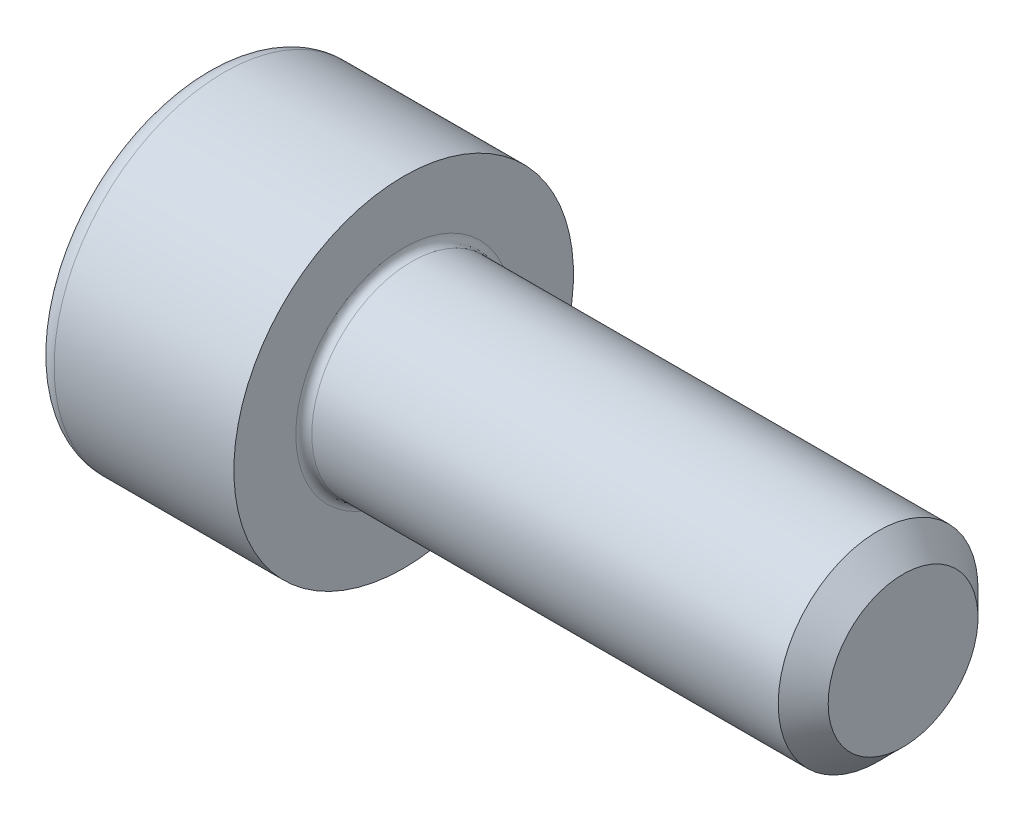
ISO-10303-21;
HEADER;
FILE_DESCRIPTION(('STEP AP214'),'2;1');
FILE_NAME('part.step','',(''),(''),'','','');
FILE_SCHEMA(('AUTOMOTIVE_DESIGN { 1 0 10303 214 1 1 1 1 }'));
ENDSEC;
DATA;
#1=APPLICATION_CONTEXT('core data for automotive mechanical design processes');
#2=APPLICATION_PROTOCOL_DEFINITION('international standard','automotive_design',2000,#1);
#3=PRODUCT_CONTEXT('',#1,'mechanical');
#4=PRODUCT('Part','Part','',(#3));
#5=PRODUCT_RELATED_PRODUCT_CATEGORY('part','',(#4));
#6=PRODUCT_DEFINITION_FORMATION('','',#4);
#7=PRODUCT_DEFINITION_CONTEXT('part definition',#1,'design');
#8=PRODUCT_DEFINITION('design','',#6,#7);
#9=PRODUCT_DEFINITION_SHAPE('','',#8);
#10=(LENGTH_UNIT() NAMED_UNIT(*) SI_UNIT(.MILLI.,.METRE.));
#11=(NAMED_UNIT(*) PLANE_ANGLE_UNIT() SI_UNIT($,.RADIAN.));
#12=(NAMED_UNIT(*) SI_UNIT($,.STERADIAN.) SOLID_ANGLE_UNIT());
#13=UNCERTAINTY_MEASURE_WITH_UNIT(LENGTH_MEASURE(1.E-05),#10,'distance_accuracy_value','');
#14=(GEOMETRIC_REPRESENTATION_CONTEXT(3) GLOBAL_UNCERTAINTY_ASSIGNED_CONTEXT((#13)) GLOBAL_UNIT_ASSIGNED_CONTEXT((#10,
#11,#12)) REPRESENTATION_CONTEXT('',''));
#15=CARTESIAN_POINT('',(0.,0.,0.));
#16=DIRECTION('',(0.,0.,1.));
#17=DIRECTION('',(1.,0.,0.));
#18=AXIS2_PLACEMENT_3D('',#15,#16,#17);
#19=CARTESIAN_POINT('',(-1.99999999995271,0.,0.));
#20=DIRECTION('',(-1.,0.,0.));
#21=DIRECTION('',(0.,0.,1.));
#22=AXIS2_PLACEMENT_3D('',#19,#20,#21);
#23=CONICAL_SURFACE('',#22,1.83319999985088,1.04719755109013);
#24=CARTESIAN_POINT('',(-0.941601486488253,-1.13686837721616E-10,0.));
#25=VERTEX_POINT('',#24);
#26=VERTEX_LOOP('',#25);
#27=FACE_BOUND('',#26,.T.);
#28=CARTESIAN_POINT('',(-2.00000000001834,0.,0.));
#29=DIRECTION('',(-1.,0.,0.));
#30=DIRECTION('',(0.,0.,1.));
#31=AXIS2_PLACEMENT_3D('',#28,#29,#30);
#32=CIRCLE('',#31,1.83319999996456);
#33=CARTESIAN_POINT('',(-2.00000000001834,-0.916599999982282,-1.58759777018694));
#34=VERTEX_POINT('',#33);
#35=CARTESIAN_POINT('',(-2.00000000001834,-1.83319999996456,0.));
#36=VERTEX_POINT('',#35);
#37=EDGE_CURVE('E89',#34,#36,#32,.T.);
#38=ORIENTED_EDGE('',*,*,#37,.T.);
#39=CARTESIAN_POINT('',(-2.00000000001834,0.,0.));
#40=DIRECTION('',(-1.,0.,0.));
#41=DIRECTION('',(0.,0.,1.));
#42=AXIS2_PLACEMENT_3D('',#39,#40,#41);
#43=CIRCLE('',#42,1.83319999996456);
#44=CARTESIAN_POINT('',(-2.00000000001834,-0.916599999982281,1.58759777018694));
#45=VERTEX_POINT('',#44);
#46=EDGE_CURVE('E84',#36,#45,#43,.T.);
#47=ORIENTED_EDGE('',*,*,#46,.T.);
#48=CARTESIAN_POINT('',(-2.00000000001834,0.,0.));
#49=DIRECTION('',(-1.,0.,0.));
#50=DIRECTION('',(0.,0.,1.));
#51=AXIS2_PLACEMENT_3D('',#48,#49,#50);
#52=CIRCLE('',#51,1.83319999996456);
#53=CARTESIAN_POINT('',(-1.99999999995271,0.916599999925436,1.58759777008849));
#54=VERTEX_POINT('',#53);
#55=EDGE_CURVE('E86',#45,#54,#52,.T.);
#56=ORIENTED_EDGE('',*,*,#55,.T.);
#57=CARTESIAN_POINT('',(-1.99999999995271,0.,0.));
#58=DIRECTION('',(-1.,0.,0.));
#59=DIRECTION('',(0.,0.,1.));
#60=AXIS2_PLACEMENT_3D('',#57,#58,#59);
#61=CIRCLE('',#60,1.83319999985088);
#62=CARTESIAN_POINT('',(-1.99999999995271,1.83319999985088,0.));
#63=VERTEX_POINT('',#62);
#64=EDGE_CURVE('E100',#54,#63,#61,.T.);
#65=ORIENTED_EDGE('',*,*,#64,.T.);
#66=CARTESIAN_POINT('',(-2.00000000001834,0.,0.));
#67=DIRECTION('',(-1.,0.,0.));
#68=DIRECTION('',(0.,0.,1.));
#69=AXIS2_PLACEMENT_3D('',#66,#67,#68);
#70=CIRCLE('',#69,1.83319999996456);
#71=CARTESIAN_POINT('',(-2.00000000001834,0.91659999998228,-1.58759777018694));
#72=VERTEX_POINT('',#71);
#73=EDGE_CURVE('E187',#63,#72,#70,.T.);
#74=ORIENTED_EDGE('',*,*,#73,.T.);
#75=CARTESIAN_POINT('',(-2.00000000001834,0.,0.));
#76=DIRECTION('',(-1.,0.,0.));
#77=DIRECTION('',(0.,0.,1.));
#78=AXIS2_PLACEMENT_3D('',#75,#76,#77);
#79=CIRCLE('',#78,1.83319999996456);
#80=EDGE_CURVE('E185',#72,#34,#79,.T.);
#81=ORIENTED_EDGE('',*,*,#80,.T.);
#82=EDGE_LOOP('',(#38,#47,#56,#65,#74,#81));
#83=FACE_BOUND('',#82,.T.);
#84=ADVANCED_FACE('F17',(#27,#83),#23,.F.);
#85=CARTESIAN_POINT('',(-2.,0.,0.));
#86=DIRECTION('',(-1.,0.,0.));
#87=DIRECTION('',(0.,-1.,0.));
#88=AXIS2_PLACEMENT_3D('',#85,#86,#87);
#89=PLANE('',#88);
#90=ORIENTED_EDGE('',*,*,#55,.F.);
#91=DIRECTION('',(0.,-1.,0.));
#92=VECTOR('',#91,1.);
#93=CARTESIAN_POINT('',(-2.,-0.9166,1.58759777021763));
#94=LINE('',#93,#92);
#95=EDGE_CURVE('E94',#45,#54,#94,.F.);
#96=ORIENTED_EDGE('',*,*,#95,.T.);
#97=EDGE_LOOP('',(#90,#96));
#98=FACE_BOUND('',#97,.T.);
#99=ADVANCED_FACE('F97',(#98),#89,.F.);
#100=CARTESIAN_POINT('',(-2.,0.,0.));
#101=DIRECTION('',(-1.,0.,0.));
#102=DIRECTION('',(0.,-1.,0.));
#103=AXIS2_PLACEMENT_3D('',#100,#101,#102);
#104=PLANE('',#103);
#105=ORIENTED_EDGE('',*,*,#64,.F.);
#106=DIRECTION('',(0.,-0.5,0.866025403784439));
#107=VECTOR('',#106,1.);
#108=CARTESIAN_POINT('',(-2.,0.9166,1.58759777021763));
#109=LINE('',#108,#107);
#110=EDGE_CURVE('E163',#54,#63,#109,.F.);
#111=ORIENTED_EDGE('',*,*,#110,.T.);
#112=EDGE_LOOP('',(#105,#111));
#113=FACE_BOUND('',#112,.T.);
#114=ADVANCED_FACE('F294',(#113),#104,.F.);
#115=CARTESIAN_POINT('',(-2.,0.,0.));
#116=DIRECTION('',(-1.,0.,0.));
#117=DIRECTION('',(0.,-1.,0.));
#118=AXIS2_PLACEMENT_3D('',#115,#116,#117);
#119=PLANE('',#118);
#120=ORIENTED_EDGE('',*,*,#73,.F.);
#121=DIRECTION('',(0.,0.5,0.866025403784439));
#122=VECTOR('',#121,1.);
#123=CARTESIAN_POINT('',(-2.,1.8332,0.));
#124=LINE('',#123,#122);
#125=EDGE_CURVE('E152',#63,#72,#124,.F.);
#126=ORIENTED_EDGE('',*,*,#125,.T.);
#127=EDGE_LOOP('',(#120,#126));
#128=FACE_BOUND('',#127,.T.);
#129=ADVANCED_FACE('F298',(#128),#119,.F.);
#130=CARTESIAN_POINT('',(-2.,0.,0.));
#131=DIRECTION('',(-1.,0.,0.));
#132=DIRECTION('',(0.,-1.,0.));
#133=AXIS2_PLACEMENT_3D('',#130,#131,#132);
#134=PLANE('',#133);
#135=ORIENTED_EDGE('',*,*,#80,.F.);
#136=DIRECTION('',(0.,1.,0.));
#137=VECTOR('',#136,1.);
#138=CARTESIAN_POINT('',(-2.,0.9166,-1.58759777021763));
#139=LINE('',#138,#137);
#140=EDGE_CURVE('E140',#72,#34,#139,.F.);
#141=ORIENTED_EDGE('',*,*,#140,.T.);
#142=EDGE_LOOP('',(#135,#141));
#143=FACE_BOUND('',#142,.T.);
#144=ADVANCED_FACE('F305',(#143),#134,.F.);
#145=CARTESIAN_POINT('',(-2.,0.,0.));
#146=DIRECTION('',(-1.,0.,0.));
#147=DIRECTION('',(0.,-1.,0.));
#148=AXIS2_PLACEMENT_3D('',#145,#146,#147);
#149=PLANE('',#148);
#150=ORIENTED_EDGE('',*,*,#37,.F.);
#151=DIRECTION('',(0.,0.5,-0.866025403784438));
#152=VECTOR('',#151,1.);
#153=CARTESIAN_POINT('',(-2.,-0.9166,-1.58759777021763));
#154=LINE('',#153,#152);
#155=EDGE_CURVE('E126',#34,#36,#154,.F.);
#156=ORIENTED_EDGE('',*,*,#155,.T.);
#157=EDGE_LOOP('',(#150,#156));
#158=FACE_BOUND('',#157,.T.);
#159=ADVANCED_FACE('F308',(#158),#149,.F.);
#160=CARTESIAN_POINT('',(-2.,0.,0.));
#161=DIRECTION('',(-1.,0.,0.));
#162=DIRECTION('',(0.,-1.,0.));
#163=AXIS2_PLACEMENT_3D('',#160,#161,#162);
#164=PLANE('',#163);
#165=ORIENTED_EDGE('',*,*,#46,.F.);
#166=DIRECTION('',(0.,-0.5,-0.866025403784438));
#167=VECTOR('',#166,1.);
#168=CARTESIAN_POINT('',(-2.,-1.8332,0.));
#169=LINE('',#168,#167);
#170=EDGE_CURVE('E102',#36,#45,#169,.F.);
#171=ORIENTED_EDGE('',*,*,#170,.T.);
#172=EDGE_LOOP('',(#165,#171));
#173=FACE_BOUND('',#172,.T.);
#174=ADVANCED_FACE('F103',(#173),#164,.F.);
#175=CARTESIAN_POINT('',(-2.,-0.9166,1.58759777021763));
#176=DIRECTION('',(0.,0.,1.));
#177=DIRECTION('',(0.,-1.,0.));
#178=AXIS2_PLACEMENT_3D('',#175,#176,#177);
#179=PLANE('',#178);
#180=DIRECTION('',(1.,0.,0.));
#181=VECTOR('',#180,1.);
#182=CARTESIAN_POINT('',(-2.,0.9166,1.58759777021763));
#183=LINE('',#182,#181);
#184=CARTESIAN_POINT('',(-4.,0.916599999999999,1.58759777021763));
#185=VERTEX_POINT('',#184);
#186=EDGE_CURVE('E114',#185,#54,#183,.T.);
#187=ORIENTED_EDGE('',*,*,#186,.T.);
#188=ORIENTED_EDGE('',*,*,#95,.F.);
#189=DIRECTION('',(1.,0.,0.));
#190=VECTOR('',#189,1.);
#191=CARTESIAN_POINT('',(-2.,-0.9166,1.58759777021763));
#192=LINE('',#191,#190);
#193=CARTESIAN_POINT('',(-4.,-0.9166,1.58759777021763));
#194=VERTEX_POINT('',#193);
#195=EDGE_CURVE('E107',#45,#194,#192,.F.);
#196=ORIENTED_EDGE('',*,*,#195,.T.);
#197=DIRECTION('',(0.,1.,0.));
#198=VECTOR('',#197,1.);
#199=CARTESIAN_POINT('',(-4.,1.8332,1.58759777021763));
#200=LINE('',#199,#198);
#201=EDGE_CURVE('E121',#194,#185,#200,.T.);
#202=ORIENTED_EDGE('',*,*,#201,.T.);
#203=EDGE_LOOP('',(#187,#188,#196,#202));
#204=FACE_BOUND('',#203,.T.);
#205=ADVANCED_FACE('F111',(#204),#179,.F.);
#206=CARTESIAN_POINT('',(-2.,0.9166,1.58759777021763));
#207=DIRECTION('',(0.,0.866025403784439,0.5));
#208=DIRECTION('',(0.,-0.5,0.866025403784439));
#209=AXIS2_PLACEMENT_3D('',#206,#207,#208);
#210=PLANE('',#209);
#211=DIRECTION('',(1.,0.,0.));
#212=VECTOR('',#211,1.);
#213=CARTESIAN_POINT('',(-2.,1.8332,0.));
#214=LINE('',#213,#212);
#215=CARTESIAN_POINT('',(-4.,1.8332,0.));
#216=VERTEX_POINT('',#215);
#217=EDGE_CURVE('E157',#216,#63,#214,.T.);
#218=ORIENTED_EDGE('',*,*,#217,.T.);
#219=ORIENTED_EDGE('',*,*,#110,.F.);
#220=ORIENTED_EDGE('',*,*,#186,.F.);
#221=DIRECTION('',(0.,0.500000000000001,-0.866025403784438));
#222=VECTOR('',#221,1.);
#223=CARTESIAN_POINT('',(-4.,0.9166,1.58759777021763));
#224=LINE('',#223,#222);
#225=EDGE_CURVE('E123',#185,#216,#224,.T.);
#226=ORIENTED_EDGE('',*,*,#225,.T.);
#227=EDGE_LOOP('',(#218,#219,#220,#226));
#228=FACE_BOUND('',#227,.T.);
#229=ADVANCED_FACE('F290',(#228),#210,.F.);
#230=CARTESIAN_POINT('',(-2.,1.8332,0.));
#231=DIRECTION('',(0.,0.866025403784439,-0.5));
#232=DIRECTION('',(0.,0.5,0.866025403784439));
#233=AXIS2_PLACEMENT_3D('',#230,#231,#232);
#234=PLANE('',#233);
#235=DIRECTION('',(1.,0.,0.));
#236=VECTOR('',#235,1.);
#237=CARTESIAN_POINT('',(-2.,0.9166,-1.58759777021763));
#238=LINE('',#237,#236);
#239=CARTESIAN_POINT('',(-4.,0.9166,-1.58759777021763));
#240=VERTEX_POINT('',#239);
#241=EDGE_CURVE('E145',#240,#72,#238,.T.);
#242=ORIENTED_EDGE('',*,*,#241,.T.);
#243=ORIENTED_EDGE('',*,*,#125,.F.);
#244=ORIENTED_EDGE('',*,*,#217,.F.);
#245=DIRECTION('',(0.,-0.499999999999999,-0.866025403784439));
#246=VECTOR('',#245,1.);
#247=CARTESIAN_POINT('',(-4.,1.8332,0.));
#248=LINE('',#247,#246);
#249=EDGE_CURVE('E147',#216,#240,#248,.T.);
#250=ORIENTED_EDGE('',*,*,#249,.T.);
#251=EDGE_LOOP('',(#242,#243,#244,#250));
#252=FACE_BOUND('',#251,.T.);
#253=ADVANCED_FACE('F301',(#252),#234,.F.);
#254=CARTESIAN_POINT('',(-2.,0.9166,-1.58759777021763));
#255=DIRECTION('',(0.,0.,-1.));
#256=DIRECTION('',(0.,1.,0.));
#257=AXIS2_PLACEMENT_3D('',#254,#255,#256);
#258=PLANE('',#257);
#259=DIRECTION('',(1.,0.,0.));
#260=VECTOR('',#259,1.);
#261=CARTESIAN_POINT('',(-2.,-0.9166,-1.58759777021763));
#262=LINE('',#261,#260);
#263=CARTESIAN_POINT('',(-4.,-0.9166,-1.58759777021763));
#264=VERTEX_POINT('',#263);
#265=EDGE_CURVE('E128',#264,#34,#262,.T.);
#266=ORIENTED_EDGE('',*,*,#265,.T.);
#267=ORIENTED_EDGE('',*,*,#140,.F.);
#268=ORIENTED_EDGE('',*,*,#241,.F.);
#269=DIRECTION('',(0.,1.,0.));
#270=VECTOR('',#269,1.);
#271=CARTESIAN_POINT('',(-4.,1.8332,-1.58759777021763));
#272=LINE('',#271,#270);
#273=EDGE_CURVE('E131',#240,#264,#272,.F.);
#274=ORIENTED_EDGE('',*,*,#273,.T.);
#275=EDGE_LOOP('',(#266,#267,#268,#274));
#276=FACE_BOUND('',#275,.T.);
#277=ADVANCED_FACE('F306',(#276),#258,.F.);
#278=CARTESIAN_POINT('',(-2.,-0.9166,-1.58759777021763));
#279=DIRECTION('',(0.,-0.866025403784438,-0.5));
#280=DIRECTION('',(0.,0.5,-0.866025403784438));
#281=AXIS2_PLACEMENT_3D('',#278,#279,#280);
#282=PLANE('',#281);
#283=DIRECTION('',(1.,0.,0.));
#284=VECTOR('',#283,1.);
#285=CARTESIAN_POINT('',(-2.,-1.8332,0.));
#286=LINE('',#285,#284);
#287=CARTESIAN_POINT('',(-4.,-1.8332,0.));
#288=VERTEX_POINT('',#287);
#289=EDGE_CURVE('E108',#288,#36,#286,.T.);
#290=ORIENTED_EDGE('',*,*,#289,.T.);
#291=ORIENTED_EDGE('',*,*,#155,.F.);
#292=ORIENTED_EDGE('',*,*,#265,.F.);
#293=DIRECTION('',(0.,-0.5,0.866025403784439));
#294=VECTOR('',#293,1.);
#295=CARTESIAN_POINT('',(-4.,-0.9166,-1.58759777021763));
#296=LINE('',#295,#294);
#297=EDGE_CURVE('E129',#264,#288,#296,.T.);
#298=ORIENTED_EDGE('',*,*,#297,.T.);
#299=EDGE_LOOP('',(#290,#291,#292,#298));
#300=FACE_BOUND('',#299,.T.);
#301=ADVANCED_FACE('F281',(#300),#282,.F.);
#302=CARTESIAN_POINT('',(-2.,-1.8332,0.));
#303=DIRECTION('',(0.,-0.866025403784438,0.5));
#304=DIRECTION('',(0.,-0.5,-0.866025403784438));
#305=AXIS2_PLACEMENT_3D('',#302,#303,#304);
#306=PLANE('',#305);
#307=ORIENTED_EDGE('',*,*,#195,.F.);
#308=ORIENTED_EDGE('',*,*,#170,.F.);
#309=ORIENTED_EDGE('',*,*,#289,.F.);
#310=DIRECTION('',(0.,0.5,0.866025403784439));
#311=VECTOR('',#310,1.);
#312=CARTESIAN_POINT('',(-4.,-1.8332,0.));
#313=LINE('',#312,#311);
#314=EDGE_CURVE('E119',#288,#194,#313,.T.);
#315=ORIENTED_EDGE('',*,*,#314,.T.);
#316=EDGE_LOOP('',(#307,#308,#309,#315));
#317=FACE_BOUND('',#316,.T.);
#318=ADVANCED_FACE('F117',(#317),#306,.F.);
#319=CARTESIAN_POINT('',(-4.,1.8332,0.));
#320=DIRECTION('',(1.,0.,0.));
#321=DIRECTION('',(0.,1.,0.));
#322=AXIS2_PLACEMENT_3D('',#319,#320,#321);
#323=PLANE('',#322);
#324=CARTESIAN_POINT('',(-4.,0.,0.));
#325=DIRECTION('',(1.,0.,0.));
#326=DIRECTION('',(0.,-1.,0.));
#327=AXIS2_PLACEMENT_3D('',#324,#325,#326);
#328=CIRCLE('',#327,3.);
#329=CARTESIAN_POINT('',(-4.,-3.,0.));
#330=VERTEX_POINT('',#329);
#331=CARTESIAN_POINT('',(-4.,3.,0.));
#332=VERTEX_POINT('',#331);
#333=EDGE_CURVE('E135',#330,#332,#328,.T.);
#334=ORIENTED_EDGE('',*,*,#333,.F.);
#335=CARTESIAN_POINT('',(-4.,0.,0.));
#336=DIRECTION('',(1.,0.,0.));
#337=DIRECTION('',(0.,1.,0.));
#338=AXIS2_PLACEMENT_3D('',#335,#336,#337);
#339=CIRCLE('',#338,3.);
#340=EDGE_CURVE('E250',#332,#330,#339,.T.);
#341=ORIENTED_EDGE('',*,*,#340,.F.);
#342=EDGE_LOOP('',(#334,#341));
#343=FACE_BOUND('',#342,.T.);
#344=ORIENTED_EDGE('',*,*,#297,.F.);
#345=ORIENTED_EDGE('',*,*,#273,.F.);
#346=ORIENTED_EDGE('',*,*,#249,.F.);
#347=ORIENTED_EDGE('',*,*,#225,.F.);
#348=ORIENTED_EDGE('',*,*,#201,.F.);
#349=ORIENTED_EDGE('',*,*,#314,.F.);
#350=EDGE_LOOP('',(#344,#345,#346,#347,#348,#349));
#351=FACE_BOUND('',#350,.T.);
#352=ADVANCED_FACE('F259',(#343,#351),#323,.F.);
#353=CARTESIAN_POINT('',(-3.6,0.,0.));
#354=DIRECTION('',(-1.,0.,0.));
#355=DIRECTION('',(0.,1.,0.));
#356=AXIS2_PLACEMENT_3D('',#353,#354,#355);
#357=TOROIDAL_SURFACE('',#356,3.,0.4);
#358=ORIENTED_EDGE('',*,*,#333,.T.);
#359=ORIENTED_EDGE('',*,*,#340,.T.);
#360=EDGE_LOOP('',(#358,#359));
#361=FACE_BOUND('',#360,.T.);
#362=CARTESIAN_POINT('',(-3.6,0.,0.));
#363=DIRECTION('',(-1.,0.,0.));
#364=DIRECTION('',(0.,-1.,0.));
#365=AXIS2_PLACEMENT_3D('',#362,#363,#364);
#366=CIRCLE('',#365,3.4);
#367=CARTESIAN_POINT('',(-3.6,-3.4,0.));
#368=VERTEX_POINT('',#367);
#369=EDGE_CURVE('E182',#368,#368,#366,.F.);
#370=ORIENTED_EDGE('',*,*,#369,.F.);
#371=EDGE_LOOP('',(#370));
#372=FACE_BOUND('',#371,.T.);
#373=ADVANCED_FACE('F254',(#361,#372),#357,.T.);
#374=CARTESIAN_POINT('',(-0.94160148652158,0.,0.));
#375=DIRECTION('',(-1.,0.,0.));
#376=DIRECTION('',(0.,-1.,0.));
#377=AXIS2_PLACEMENT_3D('',#374,#375,#376);
#378=CYLINDRICAL_SURFACE('',#377,3.4);
#379=ORIENTED_EDGE('',*,*,#369,.T.);
#380=EDGE_LOOP('',(#379));
#381=FACE_BOUND('',#380,.T.);
#382=CARTESIAN_POINT('',(0.,0.,0.));
#383=DIRECTION('',(-1.,0.,0.));
#384=DIRECTION('',(0.,-1.,0.));
#385=AXIS2_PLACEMENT_3D('',#382,#383,#384);
#386=CIRCLE('',#385,3.4);
#387=CARTESIAN_POINT('',(0.,-3.4,0.));
#388=VERTEX_POINT('',#387);
#389=EDGE_CURVE('E180',#388,#388,#386,.T.);
#390=ORIENTED_EDGE('',*,*,#389,.T.);
#391=EDGE_LOOP('',(#390));
#392=FACE_BOUND('',#391,.T.);
#393=ADVANCED_FACE('F258',(#381,#392),#378,.T.);
#394=CARTESIAN_POINT('',(10.,0.,0.));
#395=DIRECTION('',(1.,0.,0.));
#396=DIRECTION('',(0.,1.,0.));
#397=AXIS2_PLACEMENT_3D('',#394,#395,#396);
#398=PLANE('',#397);
#399=CARTESIAN_POINT('',(9.99999999999091,0.,0.));
#400=DIRECTION('',(-1.,0.,0.));
#401=DIRECTION('',(0.,0.,1.));
#402=AXIS2_PLACEMENT_3D('',#399,#400,#401);
#403=CIRCLE('',#402,1.49999999996453);
#404=CARTESIAN_POINT('',(9.99999999999091,0.,1.49999999996453));
#405=VERTEX_POINT('',#404);
#406=EDGE_CURVE('E176',#405,#405,#403,.T.);
#407=ORIENTED_EDGE('',*,*,#406,.F.);
#408=EDGE_LOOP('',(#407));
#409=FACE_BOUND('',#408,.T.);
#410=ADVANCED_FACE('F227',(#409),#398,.T.);
#411=CARTESIAN_POINT('',(0.,3.4,0.));
#412=DIRECTION('',(-1.,0.,0.));
#413=DIRECTION('',(0.,-1.,0.));
#414=AXIS2_PLACEMENT_3D('',#411,#412,#413);
#415=PLANE('',#414);
#416=CARTESIAN_POINT('',(0.,0.,0.));
#417=DIRECTION('',(1.,0.,0.));
#418=DIRECTION('',(0.,-1.,0.));
#419=AXIS2_PLACEMENT_3D('',#416,#417,#418);
#420=CIRCLE('',#419,2.16);
#421=CARTESIAN_POINT('',(0.,2.16,0.));
#422=VERTEX_POINT('',#421);
#423=CARTESIAN_POINT('',(0.,-2.16,0.));
#424=VERTEX_POINT('',#423);
#425=EDGE_CURVE('E179',#422,#424,#420,.F.);
#426=ORIENTED_EDGE('',*,*,#425,.T.);
#427=CARTESIAN_POINT('',(0.,0.,0.));
#428=DIRECTION('',(1.,0.,0.));
#429=DIRECTION('',(0.,1.,0.));
#430=AXIS2_PLACEMENT_3D('',#427,#428,#429);
#431=CIRCLE('',#430,2.16);
#432=EDGE_CURVE('E36',#424,#422,#431,.F.);
#433=ORIENTED_EDGE('',*,*,#432,.T.);
#434=EDGE_LOOP('',(#426,#433));
#435=FACE_BOUND('',#434,.T.);
#436=ORIENTED_EDGE('',*,*,#389,.F.);
#437=EDGE_LOOP('',(#436));
#438=FACE_BOUND('',#437,.T.);
#439=ADVANCED_FACE('F218',(#435,#438),#415,.F.);
#440=CARTESIAN_POINT('',(9.50000000000273,0.,0.));
#441=DIRECTION('',(-1.,0.,0.));
#442=DIRECTION('',(0.,0.,1.));
#443=AXIS2_PLACEMENT_3D('',#440,#441,#442);
#444=CONICAL_SURFACE('',#443,1.99999999995271,0.785398163397448);
#445=ORIENTED_EDGE('',*,*,#406,.T.);
#446=EDGE_LOOP('',(#445));
#447=FACE_BOUND('',#446,.T.);
#448=CARTESIAN_POINT('',(9.5,0.,0.));
#449=DIRECTION('',(-1.,0.,0.));
#450=DIRECTION('',(0.,-1.,0.));
#451=AXIS2_PLACEMENT_3D('',#448,#449,#450);
#452=CIRCLE('',#451,2.);
#453=CARTESIAN_POINT('',(9.5,-2.,0.));
#454=VERTEX_POINT('',#453);
#455=EDGE_CURVE('E28',#454,#454,#452,.T.);
#456=ORIENTED_EDGE('',*,*,#455,.F.);
#457=EDGE_LOOP('',(#456));
#458=FACE_BOUND('',#457,.T.);
#459=ADVANCED_FACE('F207',(#447,#458),#444,.T.);
#460=CARTESIAN_POINT('',(0.16,0.,0.));
#461=DIRECTION('',(-1.,0.,0.));
#462=DIRECTION('',(0.,1.,0.));
#463=AXIS2_PLACEMENT_3D('',#460,#461,#462);
#464=TOROIDAL_SURFACE('',#463,2.16,0.16);
#465=CARTESIAN_POINT('',(0.16,0.,0.));
#466=DIRECTION('',(-1.,0.,0.));
#467=DIRECTION('',(0.,-1.,0.));
#468=AXIS2_PLACEMENT_3D('',#465,#466,#467);
#469=CIRCLE('',#468,2.);
#470=CARTESIAN_POINT('',(0.16,-2.,0.));
#471=VERTEX_POINT('',#470);
#472=EDGE_CURVE('E11',#471,#471,#469,.F.);
#473=ORIENTED_EDGE('',*,*,#472,.F.);
#474=EDGE_LOOP('',(#473));
#475=FACE_BOUND('',#474,.T.);
#476=ORIENTED_EDGE('',*,*,#425,.F.);
#477=ORIENTED_EDGE('',*,*,#432,.F.);
#478=EDGE_LOOP('',(#476,#477));
#479=FACE_BOUND('',#478,.T.);
#480=ADVANCED_FACE('F195',(#475,#479),#464,.F.);
#481=CARTESIAN_POINT('',(-0.94160148652158,0.,0.));
#482=DIRECTION('',(-1.,0.,0.));
#483=DIRECTION('',(0.,-1.,0.));
#484=AXIS2_PLACEMENT_3D('',#481,#482,#483);
#485=CYLINDRICAL_SURFACE('',#484,2.);
#486=ORIENTED_EDGE('',*,*,#472,.T.);
#487=EDGE_LOOP('',(#486));
#488=FACE_BOUND('',#487,.T.);
#489=ORIENTED_EDGE('',*,*,#455,.T.);
#490=EDGE_LOOP('',(#489));
#491=FACE_BOUND('',#490,.T.);
#492=ADVANCED_FACE('F206',(#488,#491),#485,.T.);
#493=CLOSED_SHELL('',(#84,#99,#114,#129,#144,#159,#174,#205,#229,#253,#277,#301,#318,#352,#373,
#393,#410,#439,#459,#480,#492));
#494=MANIFOLD_SOLID_BREP('B1',#493);
#495=ADVANCED_BREP_SHAPE_REPRESENTATION('',(#18,#494),#14);
#496=SHAPE_DEFINITION_REPRESENTATION(#9,#495);
ENDSEC;
END-ISO-10303-21;
